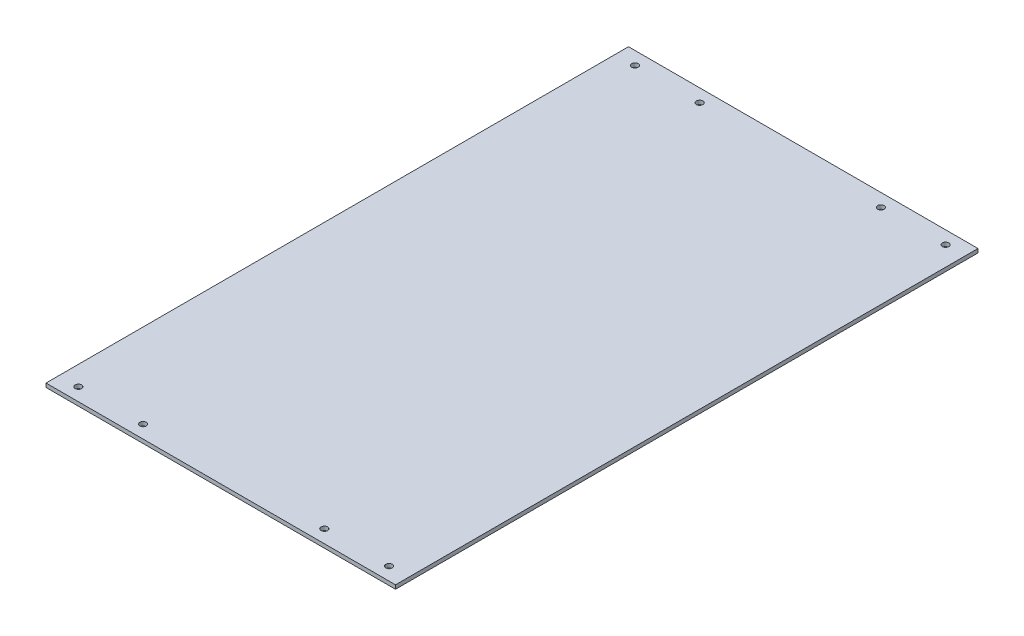
ISO-10303-21;
HEADER;
FILE_DESCRIPTION(('STEP AP214'),'2;1');
FILE_NAME('part.step','',(''),(''),'','','');
FILE_SCHEMA(('AUTOMOTIVE_DESIGN { 1 0 10303 214 1 1 1 1 }'));
ENDSEC;
DATA;
#1=APPLICATION_CONTEXT('core data for automotive mechanical design processes');
#2=APPLICATION_PROTOCOL_DEFINITION('international standard','automotive_design',2000,#1);
#3=PRODUCT_CONTEXT('',#1,'mechanical');
#4=PRODUCT('Part','Part','',(#3));
#5=PRODUCT_RELATED_PRODUCT_CATEGORY('part','',(#4));
#6=PRODUCT_DEFINITION_FORMATION('','',#4);
#7=PRODUCT_DEFINITION_CONTEXT('part definition',#1,'design');
#8=PRODUCT_DEFINITION('design','',#6,#7);
#9=PRODUCT_DEFINITION_SHAPE('','',#8);
#10=(LENGTH_UNIT() NAMED_UNIT(*) SI_UNIT(.MILLI.,.METRE.));
#11=(NAMED_UNIT(*) PLANE_ANGLE_UNIT() SI_UNIT($,.RADIAN.));
#12=(NAMED_UNIT(*) SI_UNIT($,.STERADIAN.) SOLID_ANGLE_UNIT());
#13=UNCERTAINTY_MEASURE_WITH_UNIT(LENGTH_MEASURE(1.E-05),#10,'distance_accuracy_value','');
#14=(GEOMETRIC_REPRESENTATION_CONTEXT(3) GLOBAL_UNCERTAINTY_ASSIGNED_CONTEXT((#13)) GLOBAL_UNIT_ASSIGNED_CONTEXT((#10,
#11,#12)) REPRESENTATION_CONTEXT('',''));
#15=CARTESIAN_POINT('',(0.,0.,0.));
#16=DIRECTION('',(0.,0.,1.));
#17=DIRECTION('',(1.,0.,0.));
#18=AXIS2_PLACEMENT_3D('',#15,#16,#17);
#19=CARTESIAN_POINT('',(-135.,-1.50000000000002,-450.));
#20=DIRECTION('',(-1.,0.,0.));
#21=DIRECTION('',(0.,0.,1.));
#22=AXIS2_PLACEMENT_3D('',#19,#20,#21);
#23=PLANE('',#22);
#24=DIRECTION('',(0.,-1.,0.));
#25=VECTOR('',#24,1.);
#26=CARTESIAN_POINT('',(-135.,-1.50000000000002,0.));
#27=LINE('',#26,#25);
#28=CARTESIAN_POINT('',(-135.,1.49999999999998,0.));
#29=VERTEX_POINT('',#28);
#30=CARTESIAN_POINT('',(-135.,-1.50000000000002,0.));
#31=VERTEX_POINT('',#30);
#32=EDGE_CURVE('E98',#29,#31,#27,.T.);
#33=ORIENTED_EDGE('',*,*,#32,.F.);
#34=DIRECTION('',(0.,0.,1.));
#35=VECTOR('',#34,1.);
#36=CARTESIAN_POINT('',(-135.,1.49999999999998,-450.));
#37=LINE('',#36,#35);
#38=CARTESIAN_POINT('',(-135.,1.49999999999998,-450.));
#39=VERTEX_POINT('',#38);
#40=EDGE_CURVE('E11',#39,#29,#37,.T.);
#41=ORIENTED_EDGE('',*,*,#40,.F.);
#42=DIRECTION('',(0.,-1.,0.));
#43=VECTOR('',#42,1.);
#44=CARTESIAN_POINT('',(-135.,-1.50000000000002,-450.));
#45=LINE('',#44,#43);
#46=CARTESIAN_POINT('',(-135.,-1.50000000000002,-450.));
#47=VERTEX_POINT('',#46);
#48=EDGE_CURVE('E91',#39,#47,#45,.T.);
#49=ORIENTED_EDGE('',*,*,#48,.T.);
#50=DIRECTION('',(0.,0.,1.));
#51=VECTOR('',#50,1.);
#52=CARTESIAN_POINT('',(-135.,-1.50000000000002,-450.));
#53=LINE('',#52,#51);
#54=EDGE_CURVE('E36',#47,#31,#53,.T.);
#55=ORIENTED_EDGE('',*,*,#54,.T.);
#56=EDGE_LOOP('',(#33,#41,#49,#55));
#57=FACE_BOUND('',#56,.T.);
#58=ADVANCED_FACE('F33',(#57),#23,.T.);
#59=CARTESIAN_POINT('',(135.,1.50000000000002,-450.));
#60=DIRECTION('',(0.,1.,0.));
#61=DIRECTION('',(-1.,0.,0.));
#62=AXIS2_PLACEMENT_3D('',#59,#60,#61);
#63=PLANE('',#62);
#64=CARTESIAN_POINT('',(-70.,1.49999999999999,-440.));
#65=DIRECTION('',(0.,1.,0.));
#66=DIRECTION('',(-1.,0.,0.));
#67=AXIS2_PLACEMENT_3D('',#64,#65,#66);
#68=CIRCLE('',#67,2.5);
#69=CARTESIAN_POINT('',(-72.5,1.49999999999999,-440.));
#70=VERTEX_POINT('',#69);
#71=EDGE_CURVE('E176',#70,#70,#68,.T.);
#72=ORIENTED_EDGE('',*,*,#71,.F.);
#73=EDGE_LOOP('',(#72));
#74=FACE_BOUND('',#73,.T.);
#75=CARTESIAN_POINT('',(70.,1.50000000000001,-440.));
#76=DIRECTION('',(0.,1.,0.));
#77=DIRECTION('',(1.,0.,0.));
#78=AXIS2_PLACEMENT_3D('',#75,#76,#77);
#79=CIRCLE('',#78,2.5);
#80=CARTESIAN_POINT('',(72.5,1.50000000000001,-440.));
#81=VERTEX_POINT('',#80);
#82=EDGE_CURVE('E172',#81,#81,#79,.T.);
#83=ORIENTED_EDGE('',*,*,#82,.F.);
#84=EDGE_LOOP('',(#83));
#85=FACE_BOUND('',#84,.T.);
#86=CARTESIAN_POINT('',(120.,1.50000000000001,-440.));
#87=DIRECTION('',(0.,1.,0.));
#88=DIRECTION('',(1.,0.,0.));
#89=AXIS2_PLACEMENT_3D('',#86,#87,#88);
#90=CIRCLE('',#89,2.50000000000001);
#91=CARTESIAN_POINT('',(122.5,1.50000000000002,-440.));
#92=VERTEX_POINT('',#91);
#93=EDGE_CURVE('E168',#92,#92,#90,.T.);
#94=ORIENTED_EDGE('',*,*,#93,.F.);
#95=EDGE_LOOP('',(#94));
#96=FACE_BOUND('',#95,.T.);
#97=CARTESIAN_POINT('',(120.,1.50000000000001,-10.));
#98=DIRECTION('',(0.,1.,0.));
#99=DIRECTION('',(-1.,0.,0.));
#100=AXIS2_PLACEMENT_3D('',#97,#98,#99);
#101=CIRCLE('',#100,2.50000000000001);
#102=CARTESIAN_POINT('',(117.5,1.50000000000001,-10.));
#103=VERTEX_POINT('',#102);
#104=EDGE_CURVE('E164',#103,#103,#101,.T.);
#105=ORIENTED_EDGE('',*,*,#104,.F.);
#106=EDGE_LOOP('',(#105));
#107=FACE_BOUND('',#106,.T.);
#108=CARTESIAN_POINT('',(70.,1.50000000000001,-9.99999999999995));
#109=DIRECTION('',(0.,1.,0.));
#110=DIRECTION('',(-1.,0.,0.));
#111=AXIS2_PLACEMENT_3D('',#108,#109,#110);
#112=CIRCLE('',#111,2.5);
#113=CARTESIAN_POINT('',(67.5,1.50000000000001,-9.99999999999995));
#114=VERTEX_POINT('',#113);
#115=EDGE_CURVE('E188',#114,#114,#112,.T.);
#116=ORIENTED_EDGE('',*,*,#115,.F.);
#117=EDGE_LOOP('',(#116));
#118=FACE_BOUND('',#117,.T.);
#119=CARTESIAN_POINT('',(-70.,1.49999999999999,-9.99999999999995));
#120=DIRECTION('',(0.,1.,0.));
#121=DIRECTION('',(1.,0.,0.));
#122=AXIS2_PLACEMENT_3D('',#119,#120,#121);
#123=CIRCLE('',#122,2.5);
#124=CARTESIAN_POINT('',(-67.5,1.49999999999999,-9.99999999999995));
#125=VERTEX_POINT('',#124);
#126=EDGE_CURVE('E184',#125,#125,#123,.T.);
#127=ORIENTED_EDGE('',*,*,#126,.F.);
#128=EDGE_LOOP('',(#127));
#129=FACE_BOUND('',#128,.T.);
#130=CARTESIAN_POINT('',(-120.,1.49999999999999,-10.));
#131=DIRECTION('',(0.,1.,0.));
#132=DIRECTION('',(1.,0.,0.));
#133=AXIS2_PLACEMENT_3D('',#130,#131,#132);
#134=CIRCLE('',#133,2.50000000000001);
#135=CARTESIAN_POINT('',(-117.5,1.49999999999999,-10.));
#136=VERTEX_POINT('',#135);
#137=EDGE_CURVE('E180',#136,#136,#134,.T.);
#138=ORIENTED_EDGE('',*,*,#137,.F.);
#139=EDGE_LOOP('',(#138));
#140=FACE_BOUND('',#139,.T.);
#141=CARTESIAN_POINT('',(-120.,1.49999999999999,-440.));
#142=DIRECTION('',(0.,1.,0.));
#143=DIRECTION('',(-1.,0.,0.));
#144=AXIS2_PLACEMENT_3D('',#141,#142,#143);
#145=CIRCLE('',#144,2.50000000000001);
#146=CARTESIAN_POINT('',(-122.5,1.49999999999999,-440.));
#147=VERTEX_POINT('',#146);
#148=EDGE_CURVE('E160',#147,#147,#145,.T.);
#149=ORIENTED_EDGE('',*,*,#148,.F.);
#150=EDGE_LOOP('',(#149));
#151=FACE_BOUND('',#150,.T.);
#152=DIRECTION('',(-1.,0.,0.));
#153=VECTOR('',#152,1.);
#154=CARTESIAN_POINT('',(135.,1.50000000000002,0.));
#155=LINE('',#154,#153);
#156=CARTESIAN_POINT('',(135.,1.50000000000002,0.));
#157=VERTEX_POINT('',#156);
#158=EDGE_CURVE('E93',#157,#29,#155,.T.);
#159=ORIENTED_EDGE('',*,*,#158,.F.);
#160=DIRECTION('',(0.,0.,1.));
#161=VECTOR('',#160,1.);
#162=CARTESIAN_POINT('',(135.,1.50000000000002,-450.));
#163=LINE('',#162,#161);
#164=CARTESIAN_POINT('',(135.,1.50000000000002,-450.));
#165=VERTEX_POINT('',#164);
#166=EDGE_CURVE('E42',#165,#157,#163,.T.);
#167=ORIENTED_EDGE('',*,*,#166,.F.);
#168=DIRECTION('',(-1.,0.,0.));
#169=VECTOR('',#168,1.);
#170=CARTESIAN_POINT('',(135.,1.50000000000002,-450.));
#171=LINE('',#170,#169);
#172=EDGE_CURVE('E88',#165,#39,#171,.T.);
#173=ORIENTED_EDGE('',*,*,#172,.T.);
#174=ORIENTED_EDGE('',*,*,#40,.T.);
#175=EDGE_LOOP('',(#159,#167,#173,#174));
#176=FACE_BOUND('',#175,.T.);
#177=ADVANCED_FACE('F109',(#74,#85,#96,#107,#118,#129,#140,#151,#176),#63,.T.);
#178=CARTESIAN_POINT('',(135.,-1.49999999999998,-450.));
#179=DIRECTION('',(1.,0.,0.));
#180=DIRECTION('',(0.,0.,-1.));
#181=AXIS2_PLACEMENT_3D('',#178,#179,#180);
#182=PLANE('',#181);
#183=DIRECTION('',(0.,1.,0.));
#184=VECTOR('',#183,1.);
#185=CARTESIAN_POINT('',(135.,-1.49999999999998,0.));
#186=LINE('',#185,#184);
#187=CARTESIAN_POINT('',(135.,-1.49999999999998,0.));
#188=VERTEX_POINT('',#187);
#189=EDGE_CURVE('E83',#188,#157,#186,.T.);
#190=ORIENTED_EDGE('',*,*,#189,.F.);
#191=DIRECTION('',(0.,0.,1.));
#192=VECTOR('',#191,1.);
#193=CARTESIAN_POINT('',(135.,-1.49999999999998,-450.));
#194=LINE('',#193,#192);
#195=CARTESIAN_POINT('',(135.,-1.49999999999998,-450.));
#196=VERTEX_POINT('',#195);
#197=EDGE_CURVE('E78',#196,#188,#194,.T.);
#198=ORIENTED_EDGE('',*,*,#197,.F.);
#199=DIRECTION('',(0.,1.,0.));
#200=VECTOR('',#199,1.);
#201=CARTESIAN_POINT('',(135.,-1.49999999999998,-450.));
#202=LINE('',#201,#200);
#203=EDGE_CURVE('E81',#196,#165,#202,.T.);
#204=ORIENTED_EDGE('',*,*,#203,.T.);
#205=ORIENTED_EDGE('',*,*,#166,.T.);
#206=EDGE_LOOP('',(#190,#198,#204,#205));
#207=FACE_BOUND('',#206,.T.);
#208=ADVANCED_FACE('F80',(#207),#182,.T.);
#209=CARTESIAN_POINT('',(135.,-1.49999999999998,-450.));
#210=DIRECTION('',(0.,-1.,0.));
#211=DIRECTION('',(1.,0.,0.));
#212=AXIS2_PLACEMENT_3D('',#209,#210,#211);
#213=PLANE('',#212);
#214=CARTESIAN_POINT('',(-70.,-1.50000000000004,-440.));
#215=DIRECTION('',(0.,1.,0.));
#216=DIRECTION('',(-1.,0.,0.));
#217=AXIS2_PLACEMENT_3D('',#214,#215,#216);
#218=CIRCLE('',#217,2.5);
#219=CARTESIAN_POINT('',(-72.5,-1.50000000000004,-440.));
#220=VERTEX_POINT('',#219);
#221=EDGE_CURVE('E132',#220,#220,#218,.T.);
#222=ORIENTED_EDGE('',*,*,#221,.T.);
#223=EDGE_LOOP('',(#222));
#224=FACE_BOUND('',#223,.T.);
#225=CARTESIAN_POINT('',(70.,-1.50000000000002,-440.));
#226=DIRECTION('',(0.,1.,0.));
#227=DIRECTION('',(1.,0.,0.));
#228=AXIS2_PLACEMENT_3D('',#225,#226,#227);
#229=CIRCLE('',#228,2.5);
#230=CARTESIAN_POINT('',(72.5,-1.50000000000002,-440.));
#231=VERTEX_POINT('',#230);
#232=EDGE_CURVE('E136',#231,#231,#229,.T.);
#233=ORIENTED_EDGE('',*,*,#232,.T.);
#234=EDGE_LOOP('',(#233));
#235=FACE_BOUND('',#234,.T.);
#236=CARTESIAN_POINT('',(120.,-1.50000000000002,-440.));
#237=DIRECTION('',(0.,1.,0.));
#238=DIRECTION('',(1.,0.,0.));
#239=AXIS2_PLACEMENT_3D('',#236,#237,#238);
#240=CIRCLE('',#239,2.50000000000001);
#241=CARTESIAN_POINT('',(122.5,-1.50000000000002,-440.));
#242=VERTEX_POINT('',#241);
#243=EDGE_CURVE('E140',#242,#242,#240,.T.);
#244=ORIENTED_EDGE('',*,*,#243,.T.);
#245=EDGE_LOOP('',(#244));
#246=FACE_BOUND('',#245,.T.);
#247=CARTESIAN_POINT('',(120.,-1.50000000000002,-10.));
#248=DIRECTION('',(0.,1.,0.));
#249=DIRECTION('',(-1.,0.,0.));
#250=AXIS2_PLACEMENT_3D('',#247,#248,#249);
#251=CIRCLE('',#250,2.50000000000001);
#252=CARTESIAN_POINT('',(117.5,-1.50000000000002,-10.));
#253=VERTEX_POINT('',#252);
#254=EDGE_CURVE('E144',#253,#253,#251,.T.);
#255=ORIENTED_EDGE('',*,*,#254,.T.);
#256=EDGE_LOOP('',(#255));
#257=FACE_BOUND('',#256,.T.);
#258=CARTESIAN_POINT('',(70.,-1.50000000000002,-9.99999999999995));
#259=DIRECTION('',(0.,1.,0.));
#260=DIRECTION('',(-1.,0.,0.));
#261=AXIS2_PLACEMENT_3D('',#258,#259,#260);
#262=CIRCLE('',#261,2.5);
#263=CARTESIAN_POINT('',(67.5,-1.50000000000002,-9.99999999999995));
#264=VERTEX_POINT('',#263);
#265=EDGE_CURVE('E148',#264,#264,#262,.T.);
#266=ORIENTED_EDGE('',*,*,#265,.T.);
#267=EDGE_LOOP('',(#266));
#268=FACE_BOUND('',#267,.T.);
#269=CARTESIAN_POINT('',(-70.,-1.50000000000004,-9.99999999999995));
#270=DIRECTION('',(0.,1.,0.));
#271=DIRECTION('',(1.,0.,0.));
#272=AXIS2_PLACEMENT_3D('',#269,#270,#271);
#273=CIRCLE('',#272,2.5);
#274=CARTESIAN_POINT('',(-67.5,-1.50000000000004,-9.99999999999995));
#275=VERTEX_POINT('',#274);
#276=EDGE_CURVE('E152',#275,#275,#273,.T.);
#277=ORIENTED_EDGE('',*,*,#276,.T.);
#278=EDGE_LOOP('',(#277));
#279=FACE_BOUND('',#278,.T.);
#280=CARTESIAN_POINT('',(-120.,-1.50000000000005,-10.));
#281=DIRECTION('',(0.,1.,0.));
#282=DIRECTION('',(1.,0.,0.));
#283=AXIS2_PLACEMENT_3D('',#280,#281,#282);
#284=CIRCLE('',#283,2.50000000000001);
#285=CARTESIAN_POINT('',(-117.5,-1.50000000000005,-10.));
#286=VERTEX_POINT('',#285);
#287=EDGE_CURVE('E156',#286,#286,#284,.T.);
#288=ORIENTED_EDGE('',*,*,#287,.T.);
#289=EDGE_LOOP('',(#288));
#290=FACE_BOUND('',#289,.T.);
#291=CARTESIAN_POINT('',(-120.,-1.50000000000005,-440.));
#292=DIRECTION('',(0.,1.,0.));
#293=DIRECTION('',(-1.,0.,0.));
#294=AXIS2_PLACEMENT_3D('',#291,#292,#293);
#295=CIRCLE('',#294,2.50000000000001);
#296=CARTESIAN_POINT('',(-122.5,-1.50000000000005,-440.));
#297=VERTEX_POINT('',#296);
#298=EDGE_CURVE('E102',#297,#297,#295,.T.);
#299=ORIENTED_EDGE('',*,*,#298,.T.);
#300=EDGE_LOOP('',(#299));
#301=FACE_BOUND('',#300,.T.);
#302=DIRECTION('',(1.,0.,0.));
#303=VECTOR('',#302,1.);
#304=CARTESIAN_POINT('',(135.,-1.49999999999998,0.));
#305=LINE('',#304,#303);
#306=EDGE_CURVE('E101',#31,#188,#305,.T.);
#307=ORIENTED_EDGE('',*,*,#306,.F.);
#308=ORIENTED_EDGE('',*,*,#54,.F.);
#309=DIRECTION('',(1.,0.,0.));
#310=VECTOR('',#309,1.);
#311=CARTESIAN_POINT('',(135.,-1.49999999999998,-450.));
#312=LINE('',#311,#310);
#313=EDGE_CURVE('E87',#47,#196,#312,.T.);
#314=ORIENTED_EDGE('',*,*,#313,.T.);
#315=ORIENTED_EDGE('',*,*,#197,.T.);
#316=EDGE_LOOP('',(#307,#308,#314,#315));
#317=FACE_BOUND('',#316,.T.);
#318=ADVANCED_FACE('F90',(#224,#235,#246,#257,#268,#279,#290,#301,#317),#213,.T.);
#319=CARTESIAN_POINT('',(0.,0.,-450.));
#320=DIRECTION('',(0.,0.,1.));
#321=DIRECTION('',(1.,0.,0.));
#322=AXIS2_PLACEMENT_3D('',#319,#320,#321);
#323=PLANE('',#322);
#324=ORIENTED_EDGE('',*,*,#48,.F.);
#325=ORIENTED_EDGE('',*,*,#172,.F.);
#326=ORIENTED_EDGE('',*,*,#203,.F.);
#327=ORIENTED_EDGE('',*,*,#313,.F.);
#328=EDGE_LOOP('',(#324,#325,#326,#327));
#329=FACE_BOUND('',#328,.T.);
#330=ADVANCED_FACE('F86',(#329),#323,.F.);
#331=CARTESIAN_POINT('',(0.,0.,0.));
#332=DIRECTION('',(0.,0.,1.));
#333=DIRECTION('',(1.,0.,0.));
#334=AXIS2_PLACEMENT_3D('',#331,#332,#333);
#335=PLANE('',#334);
#336=ORIENTED_EDGE('',*,*,#32,.T.);
#337=ORIENTED_EDGE('',*,*,#306,.T.);
#338=ORIENTED_EDGE('',*,*,#189,.T.);
#339=ORIENTED_EDGE('',*,*,#158,.T.);
#340=EDGE_LOOP('',(#336,#337,#338,#339));
#341=FACE_BOUND('',#340,.T.);
#342=ADVANCED_FACE('F108',(#341),#335,.T.);
#343=CARTESIAN_POINT('',(-120.,-1.50000000000005,-440.));
#344=DIRECTION('',(0.,1.,0.));
#345=DIRECTION('',(-1.,0.,0.));
#346=AXIS2_PLACEMENT_3D('',#343,#344,#345);
#347=CYLINDRICAL_SURFACE('',#346,2.50000000000001);
#348=ORIENTED_EDGE('',*,*,#298,.F.);
#349=EDGE_LOOP('',(#348));
#350=FACE_BOUND('',#349,.T.);
#351=ORIENTED_EDGE('',*,*,#148,.T.);
#352=EDGE_LOOP('',(#351));
#353=FACE_BOUND('',#352,.T.);
#354=ADVANCED_FACE('F202',(#350,#353),#347,.F.);
#355=CARTESIAN_POINT('',(-120.,-1.50000000000005,-10.));
#356=DIRECTION('',(0.,1.,0.));
#357=DIRECTION('',(-1.,0.,0.));
#358=AXIS2_PLACEMENT_3D('',#355,#356,#357);
#359=CYLINDRICAL_SURFACE('',#358,2.50000000000001);
#360=ORIENTED_EDGE('',*,*,#287,.F.);
#361=EDGE_LOOP('',(#360));
#362=FACE_BOUND('',#361,.T.);
#363=ORIENTED_EDGE('',*,*,#137,.T.);
#364=EDGE_LOOP('',(#363));
#365=FACE_BOUND('',#364,.T.);
#366=ADVANCED_FACE('F204',(#362,#365),#359,.F.);
#367=CARTESIAN_POINT('',(-70.,-1.50000000000004,-9.99999999999995));
#368=DIRECTION('',(0.,1.,0.));
#369=DIRECTION('',(-1.,0.,0.));
#370=AXIS2_PLACEMENT_3D('',#367,#368,#369);
#371=CYLINDRICAL_SURFACE('',#370,2.5);
#372=ORIENTED_EDGE('',*,*,#276,.F.);
#373=EDGE_LOOP('',(#372));
#374=FACE_BOUND('',#373,.T.);
#375=ORIENTED_EDGE('',*,*,#126,.T.);
#376=EDGE_LOOP('',(#375));
#377=FACE_BOUND('',#376,.T.);
#378=ADVANCED_FACE('F209',(#374,#377),#371,.F.);
#379=CARTESIAN_POINT('',(70.,-1.50000000000002,-9.99999999999995));
#380=DIRECTION('',(0.,1.,0.));
#381=DIRECTION('',(-1.,0.,0.));
#382=AXIS2_PLACEMENT_3D('',#379,#380,#381);
#383=CYLINDRICAL_SURFACE('',#382,2.5);
#384=ORIENTED_EDGE('',*,*,#265,.F.);
#385=EDGE_LOOP('',(#384));
#386=FACE_BOUND('',#385,.T.);
#387=ORIENTED_EDGE('',*,*,#115,.T.);
#388=EDGE_LOOP('',(#387));
#389=FACE_BOUND('',#388,.T.);
#390=ADVANCED_FACE('F193',(#386,#389),#383,.F.);
#391=CARTESIAN_POINT('',(120.,-1.50000000000002,-10.));
#392=DIRECTION('',(0.,1.,0.));
#393=DIRECTION('',(-1.,0.,0.));
#394=AXIS2_PLACEMENT_3D('',#391,#392,#393);
#395=CYLINDRICAL_SURFACE('',#394,2.50000000000001);
#396=ORIENTED_EDGE('',*,*,#254,.F.);
#397=EDGE_LOOP('',(#396));
#398=FACE_BOUND('',#397,.T.);
#399=ORIENTED_EDGE('',*,*,#104,.T.);
#400=EDGE_LOOP('',(#399));
#401=FACE_BOUND('',#400,.T.);
#402=ADVANCED_FACE('F213',(#398,#401),#395,.F.);
#403=CARTESIAN_POINT('',(120.,-1.50000000000002,-440.));
#404=DIRECTION('',(0.,1.,0.));
#405=DIRECTION('',(-1.,0.,0.));
#406=AXIS2_PLACEMENT_3D('',#403,#404,#405);
#407=CYLINDRICAL_SURFACE('',#406,2.50000000000001);
#408=ORIENTED_EDGE('',*,*,#243,.F.);
#409=EDGE_LOOP('',(#408));
#410=FACE_BOUND('',#409,.T.);
#411=ORIENTED_EDGE('',*,*,#93,.T.);
#412=EDGE_LOOP('',(#411));
#413=FACE_BOUND('',#412,.T.);
#414=ADVANCED_FACE('F216',(#410,#413),#407,.F.);
#415=CARTESIAN_POINT('',(70.,-1.50000000000002,-440.));
#416=DIRECTION('',(0.,1.,0.));
#417=DIRECTION('',(-1.,0.,0.));
#418=AXIS2_PLACEMENT_3D('',#415,#416,#417);
#419=CYLINDRICAL_SURFACE('',#418,2.5);
#420=ORIENTED_EDGE('',*,*,#232,.F.);
#421=EDGE_LOOP('',(#420));
#422=FACE_BOUND('',#421,.T.);
#423=ORIENTED_EDGE('',*,*,#82,.T.);
#424=EDGE_LOOP('',(#423));
#425=FACE_BOUND('',#424,.T.);
#426=ADVANCED_FACE('F220',(#422,#425),#419,.F.);
#427=CARTESIAN_POINT('',(-70.,-1.50000000000004,-440.));
#428=DIRECTION('',(0.,1.,0.));
#429=DIRECTION('',(-1.,0.,0.));
#430=AXIS2_PLACEMENT_3D('',#427,#428,#429);
#431=CYLINDRICAL_SURFACE('',#430,2.5);
#432=ORIENTED_EDGE('',*,*,#221,.F.);
#433=EDGE_LOOP('',(#432));
#434=FACE_BOUND('',#433,.T.);
#435=ORIENTED_EDGE('',*,*,#71,.T.);
#436=EDGE_LOOP('',(#435));
#437=FACE_BOUND('',#436,.T.);
#438=ADVANCED_FACE('F224',(#434,#437),#431,.F.);
#439=CLOSED_SHELL('',(#58,#177,#208,#318,#330,#342,#354,#366,#378,#390,#402,#414,#426,#438));
#440=MANIFOLD_SOLID_BREP('B2',#439);
#441=ADVANCED_BREP_SHAPE_REPRESENTATION('',(#18,#440),#14);
#442=SHAPE_DEFINITION_REPRESENTATION(#9,#441);
ENDSEC;
END-ISO-10303-21;
